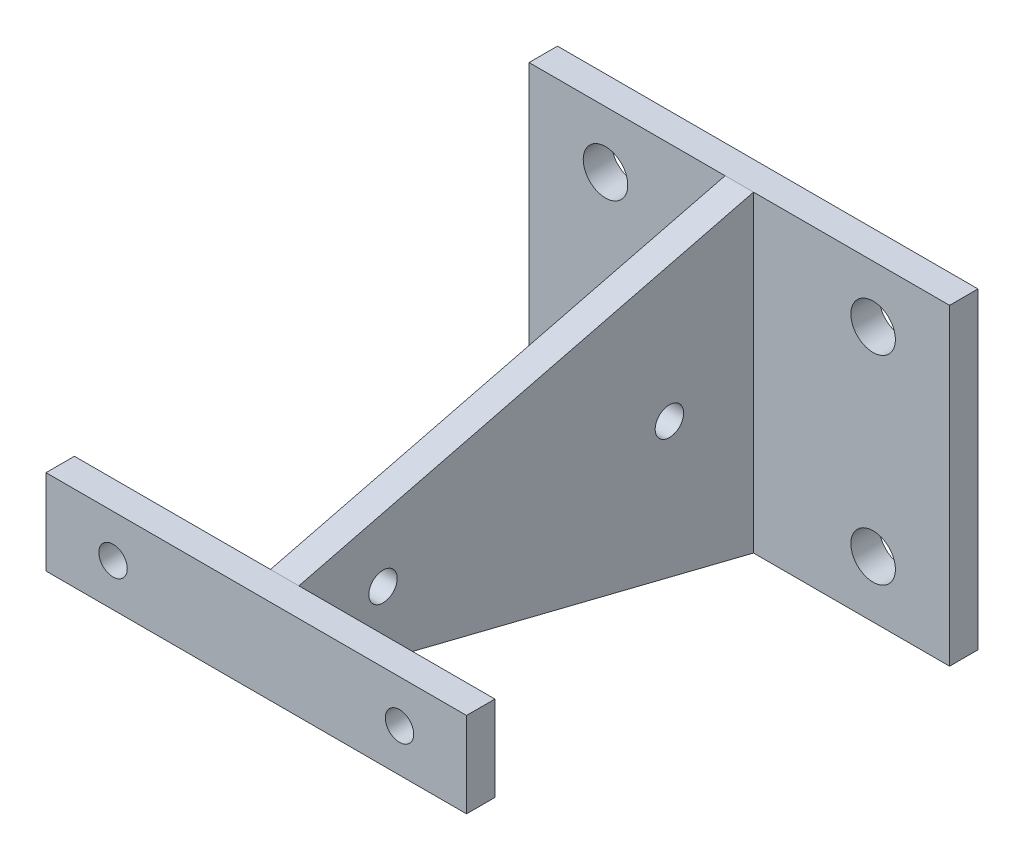
ISO-10303-21;
HEADER;
FILE_DESCRIPTION(('STEP AP214'),'2;1');
FILE_NAME('part.step','',(''),(''),'','','');
FILE_SCHEMA(('AUTOMOTIVE_DESIGN { 1 0 10303 214 1 1 1 1 }'));
ENDSEC;
DATA;
#1=APPLICATION_CONTEXT('core data for automotive mechanical design processes');
#2=APPLICATION_PROTOCOL_DEFINITION('international standard','automotive_design',2000,#1);
#3=PRODUCT_CONTEXT('',#1,'mechanical');
#4=PRODUCT('Part','Part','',(#3));
#5=PRODUCT_RELATED_PRODUCT_CATEGORY('part','',(#4));
#6=PRODUCT_DEFINITION_FORMATION('','',#4);
#7=PRODUCT_DEFINITION_CONTEXT('part definition',#1,'design');
#8=PRODUCT_DEFINITION('design','',#6,#7);
#9=PRODUCT_DEFINITION_SHAPE('','',#8);
#10=(LENGTH_UNIT() NAMED_UNIT(*) SI_UNIT(.MILLI.,.METRE.));
#11=(NAMED_UNIT(*) PLANE_ANGLE_UNIT() SI_UNIT($,.RADIAN.));
#12=(NAMED_UNIT(*) SI_UNIT($,.STERADIAN.) SOLID_ANGLE_UNIT());
#13=UNCERTAINTY_MEASURE_WITH_UNIT(LENGTH_MEASURE(1.E-05),#10,'distance_accuracy_value','');
#14=(GEOMETRIC_REPRESENTATION_CONTEXT(3) GLOBAL_UNCERTAINTY_ASSIGNED_CONTEXT((#13)) GLOBAL_UNIT_ASSIGNED_CONTEXT((#10,
#11,#12)) REPRESENTATION_CONTEXT('',''));
#15=CARTESIAN_POINT('',(0.,0.,0.));
#16=DIRECTION('',(0.,0.,1.));
#17=DIRECTION('',(1.,0.,0.));
#18=AXIS2_PLACEMENT_3D('',#15,#16,#17);
#19=CARTESIAN_POINT('',(0.,0.,0.));
#20=DIRECTION('',(0.,0.,-1.));
#21=DIRECTION('',(-1.,0.,0.));
#22=AXIS2_PLACEMENT_3D('',#19,#20,#21);
#23=PLANE('',#22);
#24=CARTESIAN_POINT('',(-16.002,0.,0.));
#25=DIRECTION('',(0.,0.,1.));
#26=DIRECTION('',(1.,0.,0.));
#27=AXIS2_PLACEMENT_3D('',#24,#25,#26);
#28=CIRCLE('',#27,1.5875);
#29=CARTESIAN_POINT('',(-14.4145,0.,0.));
#30=VERTEX_POINT('',#29);
#31=EDGE_CURVE('E201',#30,#30,#28,.T.);
#32=ORIENTED_EDGE('',*,*,#31,.T.);
#33=EDGE_LOOP('',(#32));
#34=FACE_BOUND('',#33,.T.);
#35=DIRECTION('',(-1.,0.,0.));
#36=VECTOR('',#35,1.);
#37=CARTESIAN_POINT('',(23.495,4.7625,0.));
#38=LINE('',#37,#36);
#39=CARTESIAN_POINT('',(-1.5875,4.7625,0.));
#40=VERTEX_POINT('',#39);
#41=CARTESIAN_POINT('',(-23.495,4.76249999999999,0.));
#42=VERTEX_POINT('',#41);
#43=EDGE_CURVE('E53',#40,#42,#38,.T.);
#44=ORIENTED_EDGE('',*,*,#43,.F.);
#45=DIRECTION('',(0.,-1.,0.));
#46=VECTOR('',#45,1.);
#47=CARTESIAN_POINT('',(-1.5875,4.7625,0.));
#48=LINE('',#47,#46);
#49=CARTESIAN_POINT('',(-1.5875,-4.7625,0.));
#50=VERTEX_POINT('',#49);
#51=EDGE_CURVE('E48',#40,#50,#48,.T.);
#52=ORIENTED_EDGE('',*,*,#51,.T.);
#53=DIRECTION('',(1.,0.,0.));
#54=VECTOR('',#53,1.);
#55=CARTESIAN_POINT('',(23.495,-4.7625,0.));
#56=LINE('',#55,#54);
#57=CARTESIAN_POINT('',(-23.495,-4.7625,0.));
#58=VERTEX_POINT('',#57);
#59=EDGE_CURVE('E224',#58,#50,#56,.T.);
#60=ORIENTED_EDGE('',*,*,#59,.F.);
#61=DIRECTION('',(0.,-1.,0.));
#62=VECTOR('',#61,1.);
#63=CARTESIAN_POINT('',(-23.495,4.76249999999999,0.));
#64=LINE('',#63,#62);
#65=EDGE_CURVE('E207',#42,#58,#64,.T.);
#66=ORIENTED_EDGE('',*,*,#65,.F.);
#67=EDGE_LOOP('',(#44,#52,#60,#66));
#68=FACE_BOUND('',#67,.T.);
#69=ADVANCED_FACE('F33',(#34,#68),#23,.T.);
#70=CARTESIAN_POINT('',(0.,0.,3.175));
#71=DIRECTION('',(0.,0.,-1.));
#72=DIRECTION('',(-1.,0.,0.));
#73=AXIS2_PLACEMENT_3D('',#70,#71,#72);
#74=PLANE('',#73);
#75=DIRECTION('',(0.,-1.,0.));
#76=VECTOR('',#75,1.);
#77=CARTESIAN_POINT('',(-23.495,4.76249999999999,3.175));
#78=LINE('',#77,#76);
#79=CARTESIAN_POINT('',(-23.495,4.76249999999999,3.175));
#80=VERTEX_POINT('',#79);
#81=CARTESIAN_POINT('',(-23.495,-4.7625,3.175));
#82=VERTEX_POINT('',#81);
#83=EDGE_CURVE('E210',#80,#82,#78,.T.);
#84=ORIENTED_EDGE('',*,*,#83,.T.);
#85=DIRECTION('',(1.,0.,0.));
#86=VECTOR('',#85,1.);
#87=CARTESIAN_POINT('',(23.495,-4.7625,3.175));
#88=LINE('',#87,#86);
#89=CARTESIAN_POINT('',(23.495,-4.7625,3.175));
#90=VERTEX_POINT('',#89);
#91=EDGE_CURVE('E213',#82,#90,#88,.T.);
#92=ORIENTED_EDGE('',*,*,#91,.T.);
#93=DIRECTION('',(0.,1.,0.));
#94=VECTOR('',#93,1.);
#95=CARTESIAN_POINT('',(23.495,4.7625,3.175));
#96=LINE('',#95,#94);
#97=CARTESIAN_POINT('',(23.495,4.7625,3.175));
#98=VERTEX_POINT('',#97);
#99=EDGE_CURVE('E216',#90,#98,#96,.T.);
#100=ORIENTED_EDGE('',*,*,#99,.T.);
#101=DIRECTION('',(-1.,0.,0.));
#102=VECTOR('',#101,1.);
#103=CARTESIAN_POINT('',(23.495,4.7625,3.175));
#104=LINE('',#103,#102);
#105=EDGE_CURVE('E218',#98,#80,#104,.T.);
#106=ORIENTED_EDGE('',*,*,#105,.T.);
#107=EDGE_LOOP('',(#84,#92,#100,#106));
#108=FACE_BOUND('',#107,.T.);
#109=CARTESIAN_POINT('',(-16.002,0.,3.175));
#110=DIRECTION('',(0.,0.,1.));
#111=DIRECTION('',(1.,0.,0.));
#112=AXIS2_PLACEMENT_3D('',#109,#110,#111);
#113=CIRCLE('',#112,1.5875);
#114=CARTESIAN_POINT('',(-14.4145,0.,3.175));
#115=VERTEX_POINT('',#114);
#116=EDGE_CURVE('E204',#115,#115,#113,.T.);
#117=ORIENTED_EDGE('',*,*,#116,.F.);
#118=EDGE_LOOP('',(#117));
#119=FACE_BOUND('',#118,.T.);
#120=CARTESIAN_POINT('',(16.002,0.,3.175));
#121=DIRECTION('',(0.,0.,1.));
#122=DIRECTION('',(1.,0.,0.));
#123=AXIS2_PLACEMENT_3D('',#120,#121,#122);
#124=CIRCLE('',#123,1.5875);
#125=CARTESIAN_POINT('',(17.5895,0.,3.175));
#126=VERTEX_POINT('',#125);
#127=EDGE_CURVE('E198',#126,#126,#124,.T.);
#128=ORIENTED_EDGE('',*,*,#127,.F.);
#129=EDGE_LOOP('',(#128));
#130=FACE_BOUND('',#129,.T.);
#131=ADVANCED_FACE('F273',(#108,#119,#130),#74,.F.);
#132=DIRECTION('',(0.,-1.,0.));
#133=VECTOR('',#132,1.);
#134=CARTESIAN_POINT('',(1.5875,4.7625,0.));
#135=LINE('',#134,#133);
#136=CARTESIAN_POINT('',(1.5875,4.7625,0.));
#137=VERTEX_POINT('',#136);
#138=CARTESIAN_POINT('',(1.5875,-4.7625,0.));
#139=VERTEX_POINT('',#138);
#140=EDGE_CURVE('E165',#137,#139,#135,.T.);
#141=ORIENTED_EDGE('',*,*,#140,.F.);
#142=CARTESIAN_POINT('',(23.495,4.7625,0.));
#143=VERTEX_POINT('',#142);
#144=EDGE_CURVE('E214',#143,#137,#38,.T.);
#145=ORIENTED_EDGE('',*,*,#144,.F.);
#146=DIRECTION('',(0.,1.,0.));
#147=VECTOR('',#146,1.);
#148=CARTESIAN_POINT('',(23.495,4.7625,0.));
#149=LINE('',#148,#147);
#150=CARTESIAN_POINT('',(23.495,-4.7625,0.));
#151=VERTEX_POINT('',#150);
#152=EDGE_CURVE('E226',#151,#143,#149,.T.);
#153=ORIENTED_EDGE('',*,*,#152,.F.);
#154=EDGE_CURVE('E223',#139,#151,#56,.T.);
#155=ORIENTED_EDGE('',*,*,#154,.F.);
#156=EDGE_LOOP('',(#141,#145,#153,#155));
#157=FACE_BOUND('',#156,.T.);
#158=CARTESIAN_POINT('',(16.002,0.,0.));
#159=DIRECTION('',(0.,0.,1.));
#160=DIRECTION('',(1.,0.,0.));
#161=AXIS2_PLACEMENT_3D('',#158,#159,#160);
#162=CIRCLE('',#161,1.5875);
#163=CARTESIAN_POINT('',(17.5895,0.,0.));
#164=VERTEX_POINT('',#163);
#165=EDGE_CURVE('E197',#164,#164,#162,.T.);
#166=ORIENTED_EDGE('',*,*,#165,.T.);
#167=EDGE_LOOP('',(#166));
#168=FACE_BOUND('',#167,.T.);
#169=ADVANCED_FACE('F245',(#157,#168),#23,.T.);
#170=CARTESIAN_POINT('',(-23.495,4.76249999999999,3.175));
#171=DIRECTION('',(1.,0.,0.));
#172=DIRECTION('',(0.,0.,-1.));
#173=AXIS2_PLACEMENT_3D('',#170,#171,#172);
#174=PLANE('',#173);
#175=ORIENTED_EDGE('',*,*,#65,.T.);
#176=DIRECTION('',(0.,0.,-1.));
#177=VECTOR('',#176,1.);
#178=CARTESIAN_POINT('',(-23.495,-4.7625,3.175));
#179=LINE('',#178,#177);
#180=EDGE_CURVE('E11',#82,#58,#179,.T.);
#181=ORIENTED_EDGE('',*,*,#180,.F.);
#182=ORIENTED_EDGE('',*,*,#83,.F.);
#183=DIRECTION('',(0.,0.,-1.));
#184=VECTOR('',#183,1.);
#185=CARTESIAN_POINT('',(-23.495,4.76249999999999,3.175));
#186=LINE('',#185,#184);
#187=EDGE_CURVE('E220',#80,#42,#186,.T.);
#188=ORIENTED_EDGE('',*,*,#187,.T.);
#189=EDGE_LOOP('',(#175,#181,#182,#188));
#190=FACE_BOUND('',#189,.T.);
#191=ADVANCED_FACE('F35',(#190),#174,.F.);
#192=CARTESIAN_POINT('',(23.495,-4.7625,3.175));
#193=DIRECTION('',(0.,1.,0.));
#194=DIRECTION('',(0.,0.,1.));
#195=AXIS2_PLACEMENT_3D('',#192,#193,#194);
#196=PLANE('',#195);
#197=ORIENTED_EDGE('',*,*,#59,.T.);
#198=DIRECTION('',(-1.,0.,0.));
#199=VECTOR('',#198,1.);
#200=CARTESIAN_POINT('',(1.5875,-4.7625,0.));
#201=LINE('',#200,#199);
#202=EDGE_CURVE('E194',#139,#50,#201,.T.);
#203=ORIENTED_EDGE('',*,*,#202,.F.);
#204=ORIENTED_EDGE('',*,*,#154,.T.);
#205=DIRECTION('',(0.,0.,-1.));
#206=VECTOR('',#205,1.);
#207=CARTESIAN_POINT('',(23.495,-4.7625,3.175));
#208=LINE('',#207,#206);
#209=EDGE_CURVE('E41',#90,#151,#208,.T.);
#210=ORIENTED_EDGE('',*,*,#209,.F.);
#211=ORIENTED_EDGE('',*,*,#91,.F.);
#212=ORIENTED_EDGE('',*,*,#180,.T.);
#213=EDGE_LOOP('',(#197,#203,#204,#210,#211,#212));
#214=FACE_BOUND('',#213,.T.);
#215=ADVANCED_FACE('F267',(#214),#196,.F.);
#216=CARTESIAN_POINT('',(23.495,4.7625,3.175));
#217=DIRECTION('',(-1.,0.,0.));
#218=DIRECTION('',(0.,0.,1.));
#219=AXIS2_PLACEMENT_3D('',#216,#217,#218);
#220=PLANE('',#219);
#221=ORIENTED_EDGE('',*,*,#152,.T.);
#222=DIRECTION('',(0.,0.,-1.));
#223=VECTOR('',#222,1.);
#224=CARTESIAN_POINT('',(23.495,4.7625,3.175));
#225=LINE('',#224,#223);
#226=EDGE_CURVE('E232',#98,#143,#225,.T.);
#227=ORIENTED_EDGE('',*,*,#226,.F.);
#228=ORIENTED_EDGE('',*,*,#99,.F.);
#229=ORIENTED_EDGE('',*,*,#209,.T.);
#230=EDGE_LOOP('',(#221,#227,#228,#229));
#231=FACE_BOUND('',#230,.T.);
#232=ADVANCED_FACE('F239',(#231),#220,.F.);
#233=CARTESIAN_POINT('',(23.495,4.7625,3.175));
#234=DIRECTION('',(0.,-1.,0.));
#235=DIRECTION('',(1.,0.,0.));
#236=AXIS2_PLACEMENT_3D('',#233,#234,#235);
#237=PLANE('',#236);
#238=ORIENTED_EDGE('',*,*,#144,.T.);
#239=DIRECTION('',(-1.,0.,0.));
#240=VECTOR('',#239,1.);
#241=CARTESIAN_POINT('',(1.5875,4.7625,0.));
#242=LINE('',#241,#240);
#243=EDGE_CURVE('E178',#137,#40,#242,.T.);
#244=ORIENTED_EDGE('',*,*,#243,.T.);
#245=ORIENTED_EDGE('',*,*,#43,.T.);
#246=ORIENTED_EDGE('',*,*,#187,.F.);
#247=ORIENTED_EDGE('',*,*,#105,.F.);
#248=ORIENTED_EDGE('',*,*,#226,.T.);
#249=EDGE_LOOP('',(#238,#244,#245,#246,#247,#248));
#250=FACE_BOUND('',#249,.T.);
#251=ADVANCED_FACE('F249',(#250),#237,.F.);
#252=CARTESIAN_POINT('',(-16.002,0.,3.175));
#253=DIRECTION('',(0.,0.,-1.));
#254=DIRECTION('',(-1.,0.,0.));
#255=AXIS2_PLACEMENT_3D('',#252,#253,#254);
#256=CYLINDRICAL_SURFACE('',#255,1.5875);
#257=ORIENTED_EDGE('',*,*,#116,.T.);
#258=EDGE_LOOP('',(#257));
#259=FACE_BOUND('',#258,.T.);
#260=ORIENTED_EDGE('',*,*,#31,.F.);
#261=EDGE_LOOP('',(#260));
#262=FACE_BOUND('',#261,.T.);
#263=ADVANCED_FACE('F284',(#259,#262),#256,.F.);
#264=CARTESIAN_POINT('',(16.002,0.,3.175));
#265=DIRECTION('',(0.,0.,-1.));
#266=DIRECTION('',(-1.,0.,0.));
#267=AXIS2_PLACEMENT_3D('',#264,#265,#266);
#268=CYLINDRICAL_SURFACE('',#267,1.5875);
#269=ORIENTED_EDGE('',*,*,#127,.T.);
#270=EDGE_LOOP('',(#269));
#271=FACE_BOUND('',#270,.T.);
#272=ORIENTED_EDGE('',*,*,#165,.F.);
#273=EDGE_LOOP('',(#272));
#274=FACE_BOUND('',#273,.T.);
#275=ADVANCED_FACE('F281',(#271,#274),#268,.F.);
#276=CARTESIAN_POINT('',(1.5875,0.,0.));
#277=DIRECTION('',(-1.,0.,0.));
#278=DIRECTION('',(0.,0.,1.));
#279=AXIS2_PLACEMENT_3D('',#276,#277,#278);
#280=PLANE('',#279);
#281=ORIENTED_EDGE('',*,*,#140,.T.);
#282=DIRECTION('',(0.,-0.242535625036333,-0.970142500145332));
#283=VECTOR('',#282,1.);
#284=CARTESIAN_POINT('',(1.5875,-17.4625,-50.8));
#285=LINE('',#284,#283);
#286=CARTESIAN_POINT('',(1.5875,-17.4625,-50.8));
#287=VERTEX_POINT('',#286);
#288=EDGE_CURVE('E168',#139,#287,#285,.T.);
#289=ORIENTED_EDGE('',*,*,#288,.T.);
#290=DIRECTION('',(0.,1.,0.));
#291=VECTOR('',#290,1.);
#292=CARTESIAN_POINT('',(1.5875,17.4625,-50.8));
#293=LINE('',#292,#291);
#294=CARTESIAN_POINT('',(1.5875,17.4625,-50.8));
#295=VERTEX_POINT('',#294);
#296=EDGE_CURVE('E172',#287,#295,#293,.T.);
#297=ORIENTED_EDGE('',*,*,#296,.T.);
#298=DIRECTION('',(0.,-0.242535625036333,0.970142500145332));
#299=VECTOR('',#298,1.);
#300=CARTESIAN_POINT('',(1.5875,17.4625,-50.8));
#301=LINE('',#300,#299);
#302=EDGE_CURVE('E175',#295,#137,#301,.T.);
#303=ORIENTED_EDGE('',*,*,#302,.T.);
#304=EDGE_LOOP('',(#281,#289,#297,#303));
#305=FACE_BOUND('',#304,.T.);
#306=CARTESIAN_POINT('',(1.5875,0.,-9.398));
#307=DIRECTION('',(1.,0.,0.));
#308=DIRECTION('',(0.,0.,-1.));
#309=AXIS2_PLACEMENT_3D('',#306,#307,#308);
#310=CIRCLE('',#309,1.5875);
#311=CARTESIAN_POINT('',(1.5875,0.,-10.9855));
#312=VERTEX_POINT('',#311);
#313=EDGE_CURVE('E160',#312,#312,#310,.T.);
#314=ORIENTED_EDGE('',*,*,#313,.F.);
#315=EDGE_LOOP('',(#314));
#316=FACE_BOUND('',#315,.T.);
#317=CARTESIAN_POINT('',(1.5875,0.,-41.402));
#318=DIRECTION('',(1.,0.,0.));
#319=DIRECTION('',(0.,0.,-1.));
#320=AXIS2_PLACEMENT_3D('',#317,#318,#319);
#321=CIRCLE('',#320,1.5875);
#322=CARTESIAN_POINT('',(1.5875,0.,-42.9895));
#323=VERTEX_POINT('',#322);
#324=EDGE_CURVE('E151',#323,#323,#321,.T.);
#325=ORIENTED_EDGE('',*,*,#324,.F.);
#326=EDGE_LOOP('',(#325));
#327=FACE_BOUND('',#326,.T.);
#328=ADVANCED_FACE('F254',(#305,#316,#327),#280,.F.);
#329=CARTESIAN_POINT('',(-1.5875,0.,0.));
#330=DIRECTION('',(-1.,0.,0.));
#331=DIRECTION('',(0.,0.,1.));
#332=AXIS2_PLACEMENT_3D('',#329,#330,#331);
#333=PLANE('',#332);
#334=CARTESIAN_POINT('',(-1.5875,0.,-9.398));
#335=DIRECTION('',(1.,0.,0.));
#336=DIRECTION('',(0.,0.,-1.));
#337=AXIS2_PLACEMENT_3D('',#334,#335,#336);
#338=CIRCLE('',#337,1.5875);
#339=CARTESIAN_POINT('',(-1.5875,0.,-10.9855));
#340=VERTEX_POINT('',#339);
#341=EDGE_CURVE('E158',#340,#340,#338,.T.);
#342=ORIENTED_EDGE('',*,*,#341,.T.);
#343=EDGE_LOOP('',(#342));
#344=FACE_BOUND('',#343,.T.);
#345=ORIENTED_EDGE('',*,*,#51,.F.);
#346=DIRECTION('',(0.,-0.242535625036333,0.970142500145332));
#347=VECTOR('',#346,1.);
#348=CARTESIAN_POINT('',(-1.5875,17.4625,-50.8));
#349=LINE('',#348,#347);
#350=CARTESIAN_POINT('',(-1.5875,17.4625,-50.8));
#351=VERTEX_POINT('',#350);
#352=EDGE_CURVE('E169',#351,#40,#349,.T.);
#353=ORIENTED_EDGE('',*,*,#352,.F.);
#354=DIRECTION('',(0.,1.,0.));
#355=VECTOR('',#354,1.);
#356=CARTESIAN_POINT('',(-1.5875,17.4625,-50.8));
#357=LINE('',#356,#355);
#358=CARTESIAN_POINT('',(-1.5875,-17.4625,-50.8));
#359=VERTEX_POINT('',#358);
#360=EDGE_CURVE('E183',#359,#351,#357,.T.);
#361=ORIENTED_EDGE('',*,*,#360,.F.);
#362=DIRECTION('',(0.,-0.242535625036333,-0.970142500145332));
#363=VECTOR('',#362,1.);
#364=CARTESIAN_POINT('',(-1.5875,-17.4625,-50.8));
#365=LINE('',#364,#363);
#366=EDGE_CURVE('E180',#50,#359,#365,.T.);
#367=ORIENTED_EDGE('',*,*,#366,.F.);
#368=EDGE_LOOP('',(#345,#353,#361,#367));
#369=FACE_BOUND('',#368,.T.);
#370=CARTESIAN_POINT('',(-1.5875,0.,-41.402));
#371=DIRECTION('',(1.,0.,0.));
#372=DIRECTION('',(0.,0.,-1.));
#373=AXIS2_PLACEMENT_3D('',#370,#371,#372);
#374=CIRCLE('',#373,1.5875);
#375=CARTESIAN_POINT('',(-1.5875,0.,-42.9895));
#376=VERTEX_POINT('',#375);
#377=EDGE_CURVE('E148',#376,#376,#374,.T.);
#378=ORIENTED_EDGE('',*,*,#377,.T.);
#379=EDGE_LOOP('',(#378));
#380=FACE_BOUND('',#379,.T.);
#381=ADVANCED_FACE('F262',(#344,#369,#380),#333,.T.);
#382=CARTESIAN_POINT('',(1.5875,-17.4625,-50.8));
#383=DIRECTION('',(0.,0.970142500145332,-0.242535625036333));
#384=DIRECTION('',(0.,0.242535625036333,0.970142500145332));
#385=AXIS2_PLACEMENT_3D('',#382,#383,#384);
#386=PLANE('',#385);
#387=ORIENTED_EDGE('',*,*,#366,.T.);
#388=DIRECTION('',(-1.,0.,0.));
#389=VECTOR('',#388,1.);
#390=CARTESIAN_POINT('',(1.5875,-17.4625,-50.8));
#391=LINE('',#390,#389);
#392=EDGE_CURVE('E191',#287,#359,#391,.T.);
#393=ORIENTED_EDGE('',*,*,#392,.F.);
#394=ORIENTED_EDGE('',*,*,#288,.F.);
#395=ORIENTED_EDGE('',*,*,#202,.T.);
#396=EDGE_LOOP('',(#387,#393,#394,#395));
#397=FACE_BOUND('',#396,.T.);
#398=ADVANCED_FACE('F266',(#397),#386,.F.);
#399=CARTESIAN_POINT('',(1.5875,17.4625,-50.8));
#400=DIRECTION('',(0.,-0.970142500145332,-0.242535625036333));
#401=DIRECTION('',(0.,0.242535625036333,-0.970142500145332));
#402=AXIS2_PLACEMENT_3D('',#399,#400,#401);
#403=PLANE('',#402);
#404=ORIENTED_EDGE('',*,*,#352,.T.);
#405=ORIENTED_EDGE('',*,*,#243,.F.);
#406=ORIENTED_EDGE('',*,*,#302,.F.);
#407=DIRECTION('',(-1.,0.,0.));
#408=VECTOR('',#407,1.);
#409=CARTESIAN_POINT('',(1.5875,17.4625,-50.8));
#410=LINE('',#409,#408);
#411=EDGE_CURVE('E188',#295,#351,#410,.T.);
#412=ORIENTED_EDGE('',*,*,#411,.T.);
#413=EDGE_LOOP('',(#404,#405,#406,#412));
#414=FACE_BOUND('',#413,.T.);
#415=ADVANCED_FACE('F257',(#414),#403,.F.);
#416=CARTESIAN_POINT('',(1.5875,0.,-9.398));
#417=DIRECTION('',(-1.,0.,0.));
#418=DIRECTION('',(0.,0.,1.));
#419=AXIS2_PLACEMENT_3D('',#416,#417,#418);
#420=CYLINDRICAL_SURFACE('',#419,1.5875);
#421=ORIENTED_EDGE('',*,*,#313,.T.);
#422=EDGE_LOOP('',(#421));
#423=FACE_BOUND('',#422,.T.);
#424=ORIENTED_EDGE('',*,*,#341,.F.);
#425=EDGE_LOOP('',(#424));
#426=FACE_BOUND('',#425,.T.);
#427=ADVANCED_FACE('F310',(#423,#426),#420,.F.);
#428=CARTESIAN_POINT('',(1.5875,0.,-41.402));
#429=DIRECTION('',(-1.,0.,0.));
#430=DIRECTION('',(0.,0.,1.));
#431=AXIS2_PLACEMENT_3D('',#428,#429,#430);
#432=CYLINDRICAL_SURFACE('',#431,1.5875);
#433=ORIENTED_EDGE('',*,*,#324,.T.);
#434=EDGE_LOOP('',(#433));
#435=FACE_BOUND('',#434,.T.);
#436=ORIENTED_EDGE('',*,*,#377,.F.);
#437=EDGE_LOOP('',(#436));
#438=FACE_BOUND('',#437,.T.);
#439=ADVANCED_FACE('F318',(#435,#438),#432,.F.);
#440=CARTESIAN_POINT('',(0.,0.,-50.8));
#441=DIRECTION('',(0.,0.,-1.));
#442=DIRECTION('',(-1.,0.,0.));
#443=AXIS2_PLACEMENT_3D('',#440,#441,#442);
#444=PLANE('',#443);
#445=CARTESIAN_POINT('',(-14.9513636363636,-11.1125,-50.8));
#446=DIRECTION('',(0.,0.,-1.));
#447=DIRECTION('',(-1.,0.,0.));
#448=AXIS2_PLACEMENT_3D('',#445,#446,#447);
#449=CIRCLE('',#448,2.4892);
#450=CARTESIAN_POINT('',(-17.4405636363636,-11.1125,-50.8));
#451=VERTEX_POINT('',#450);
#452=EDGE_CURVE('E369',#451,#451,#449,.T.);
#453=ORIENTED_EDGE('',*,*,#452,.T.);
#454=EDGE_LOOP('',(#453));
#455=FACE_BOUND('',#454,.T.);
#456=CARTESIAN_POINT('',(-14.9513636363636,11.1125,-50.8));
#457=DIRECTION('',(0.,0.,-1.));
#458=DIRECTION('',(-1.,0.,0.));
#459=AXIS2_PLACEMENT_3D('',#456,#457,#458);
#460=CIRCLE('',#459,2.4892);
#461=CARTESIAN_POINT('',(-17.4405636363636,11.1125,-50.8));
#462=VERTEX_POINT('',#461);
#463=EDGE_CURVE('E375',#462,#462,#460,.T.);
#464=ORIENTED_EDGE('',*,*,#463,.T.);
#465=EDGE_LOOP('',(#464));
#466=FACE_BOUND('',#465,.T.);
#467=DIRECTION('',(-1.,0.,0.));
#468=VECTOR('',#467,1.);
#469=CARTESIAN_POINT('',(23.495,-17.4625,-50.8));
#470=LINE('',#469,#468);
#471=CARTESIAN_POINT('',(-23.495,-17.4625,-50.8));
#472=VERTEX_POINT('',#471);
#473=EDGE_CURVE('E398',#359,#472,#470,.T.);
#474=ORIENTED_EDGE('',*,*,#473,.F.);
#475=ORIENTED_EDGE('',*,*,#360,.T.);
#476=DIRECTION('',(1.,0.,0.));
#477=VECTOR('',#476,1.);
#478=CARTESIAN_POINT('',(23.495,17.4625,-50.8));
#479=LINE('',#478,#477);
#480=CARTESIAN_POINT('',(-23.495,17.4625,-50.8));
#481=VERTEX_POINT('',#480);
#482=EDGE_CURVE('E394',#481,#351,#479,.T.);
#483=ORIENTED_EDGE('',*,*,#482,.F.);
#484=DIRECTION('',(0.,1.,0.));
#485=VECTOR('',#484,1.);
#486=CARTESIAN_POINT('',(-23.495,17.4625,-50.8));
#487=LINE('',#486,#485);
#488=EDGE_CURVE('E147',#472,#481,#487,.T.);
#489=ORIENTED_EDGE('',*,*,#488,.F.);
#490=EDGE_LOOP('',(#474,#475,#483,#489));
#491=FACE_BOUND('',#490,.T.);
#492=ADVANCED_FACE('F322',(#455,#466,#491),#444,.F.);
#493=CARTESIAN_POINT('',(0.,0.,-53.975));
#494=DIRECTION('',(0.,0.,-1.));
#495=DIRECTION('',(-1.,0.,0.));
#496=AXIS2_PLACEMENT_3D('',#493,#494,#495);
#497=PLANE('',#496);
#498=CARTESIAN_POINT('',(-14.9513636363636,-11.1125,-53.975));
#499=DIRECTION('',(0.,0.,-1.));
#500=DIRECTION('',(-1.,0.,0.));
#501=AXIS2_PLACEMENT_3D('',#498,#499,#500);
#502=CIRCLE('',#501,2.4892);
#503=CARTESIAN_POINT('',(-17.4405636363636,-11.1125,-53.975));
#504=VERTEX_POINT('',#503);
#505=EDGE_CURVE('E372',#504,#504,#502,.T.);
#506=ORIENTED_EDGE('',*,*,#505,.F.);
#507=EDGE_LOOP('',(#506));
#508=FACE_BOUND('',#507,.T.);
#509=CARTESIAN_POINT('',(14.9513636363636,11.1125,-53.975));
#510=DIRECTION('',(0.,0.,-1.));
#511=DIRECTION('',(-1.,0.,0.));
#512=AXIS2_PLACEMENT_3D('',#509,#510,#511);
#513=CIRCLE('',#512,2.4892);
#514=CARTESIAN_POINT('',(12.4621636363636,11.1125,-53.975));
#515=VERTEX_POINT('',#514);
#516=EDGE_CURVE('E384',#515,#515,#513,.T.);
#517=ORIENTED_EDGE('',*,*,#516,.F.);
#518=EDGE_LOOP('',(#517));
#519=FACE_BOUND('',#518,.T.);
#520=DIRECTION('',(0.,1.,0.));
#521=VECTOR('',#520,1.);
#522=CARTESIAN_POINT('',(-23.495,17.4625,-53.975));
#523=LINE('',#522,#521);
#524=CARTESIAN_POINT('',(-23.495,-17.4625,-53.975));
#525=VERTEX_POINT('',#524);
#526=CARTESIAN_POINT('',(-23.495,17.4625,-53.975));
#527=VERTEX_POINT('',#526);
#528=EDGE_CURVE('E133',#525,#527,#523,.T.);
#529=ORIENTED_EDGE('',*,*,#528,.T.);
#530=DIRECTION('',(1.,0.,0.));
#531=VECTOR('',#530,1.);
#532=CARTESIAN_POINT('',(23.495,17.4625,-53.975));
#533=LINE('',#532,#531);
#534=CARTESIAN_POINT('',(23.495,17.4625,-53.975));
#535=VERTEX_POINT('',#534);
#536=EDGE_CURVE('E121',#527,#535,#533,.T.);
#537=ORIENTED_EDGE('',*,*,#536,.T.);
#538=DIRECTION('',(0.,-1.,0.));
#539=VECTOR('',#538,1.);
#540=CARTESIAN_POINT('',(23.495,17.4625,-53.975));
#541=LINE('',#540,#539);
#542=CARTESIAN_POINT('',(23.495,-17.4625,-53.975));
#543=VERTEX_POINT('',#542);
#544=EDGE_CURVE('E132',#535,#543,#541,.T.);
#545=ORIENTED_EDGE('',*,*,#544,.T.);
#546=DIRECTION('',(-1.,0.,0.));
#547=VECTOR('',#546,1.);
#548=CARTESIAN_POINT('',(23.495,-17.4625,-53.975));
#549=LINE('',#548,#547);
#550=EDGE_CURVE('E139',#543,#525,#549,.T.);
#551=ORIENTED_EDGE('',*,*,#550,.T.);
#552=EDGE_LOOP('',(#529,#537,#545,#551));
#553=FACE_BOUND('',#552,.T.);
#554=CARTESIAN_POINT('',(-14.9513636363636,11.1125,-53.975));
#555=DIRECTION('',(0.,0.,-1.));
#556=DIRECTION('',(-1.,0.,0.));
#557=AXIS2_PLACEMENT_3D('',#554,#555,#556);
#558=CIRCLE('',#557,2.4892);
#559=CARTESIAN_POINT('',(-17.4405636363636,11.1125,-53.975));
#560=VERTEX_POINT('',#559);
#561=EDGE_CURVE('E378',#560,#560,#558,.T.);
#562=ORIENTED_EDGE('',*,*,#561,.F.);
#563=EDGE_LOOP('',(#562));
#564=FACE_BOUND('',#563,.T.);
#565=CARTESIAN_POINT('',(14.9513636363636,-11.1125,-53.975));
#566=DIRECTION('',(0.,0.,-1.));
#567=DIRECTION('',(-1.,0.,0.));
#568=AXIS2_PLACEMENT_3D('',#565,#566,#567);
#569=CIRCLE('',#568,2.4892);
#570=CARTESIAN_POINT('',(12.4621636363636,-11.1125,-53.975));
#571=VERTEX_POINT('',#570);
#572=EDGE_CURVE('E363',#571,#571,#569,.T.);
#573=ORIENTED_EDGE('',*,*,#572,.F.);
#574=EDGE_LOOP('',(#573));
#575=FACE_BOUND('',#574,.T.);
#576=ADVANCED_FACE('F136',(#508,#519,#553,#564,#575),#497,.T.);
#577=ORIENTED_EDGE('',*,*,#296,.F.);
#578=CARTESIAN_POINT('',(23.495,-17.4625,-50.8));
#579=VERTEX_POINT('',#578);
#580=EDGE_CURVE('E143',#579,#287,#470,.T.);
#581=ORIENTED_EDGE('',*,*,#580,.F.);
#582=DIRECTION('',(0.,-1.,0.));
#583=VECTOR('',#582,1.);
#584=CARTESIAN_POINT('',(23.495,17.4625,-50.8));
#585=LINE('',#584,#583);
#586=CARTESIAN_POINT('',(23.495,17.4625,-50.8));
#587=VERTEX_POINT('',#586);
#588=EDGE_CURVE('E396',#587,#579,#585,.T.);
#589=ORIENTED_EDGE('',*,*,#588,.F.);
#590=EDGE_CURVE('E393',#295,#587,#479,.T.);
#591=ORIENTED_EDGE('',*,*,#590,.F.);
#592=EDGE_LOOP('',(#577,#581,#589,#591));
#593=FACE_BOUND('',#592,.T.);
#594=CARTESIAN_POINT('',(14.9513636363636,11.1125,-50.8));
#595=DIRECTION('',(0.,0.,-1.));
#596=DIRECTION('',(-1.,0.,0.));
#597=AXIS2_PLACEMENT_3D('',#594,#595,#596);
#598=CIRCLE('',#597,2.4892);
#599=CARTESIAN_POINT('',(12.4621636363636,11.1125,-50.8));
#600=VERTEX_POINT('',#599);
#601=EDGE_CURVE('E381',#600,#600,#598,.T.);
#602=ORIENTED_EDGE('',*,*,#601,.T.);
#603=EDGE_LOOP('',(#602));
#604=FACE_BOUND('',#603,.T.);
#605=CARTESIAN_POINT('',(14.9513636363636,-11.1125,-50.8));
#606=DIRECTION('',(0.,0.,-1.));
#607=DIRECTION('',(-1.,0.,0.));
#608=AXIS2_PLACEMENT_3D('',#605,#606,#607);
#609=CIRCLE('',#608,2.4892);
#610=CARTESIAN_POINT('',(12.4621636363636,-11.1125,-50.8));
#611=VERTEX_POINT('',#610);
#612=EDGE_CURVE('E366',#611,#611,#609,.T.);
#613=ORIENTED_EDGE('',*,*,#612,.T.);
#614=EDGE_LOOP('',(#613));
#615=FACE_BOUND('',#614,.T.);
#616=ADVANCED_FACE('F326',(#593,#604,#615),#444,.F.);
#617=CARTESIAN_POINT('',(-23.495,17.4625,-53.975));
#618=DIRECTION('',(1.,0.,0.));
#619=DIRECTION('',(0.,0.,-1.));
#620=AXIS2_PLACEMENT_3D('',#617,#618,#619);
#621=PLANE('',#620);
#622=ORIENTED_EDGE('',*,*,#488,.T.);
#623=DIRECTION('',(0.,0.,1.));
#624=VECTOR('',#623,1.);
#625=CARTESIAN_POINT('',(-23.495,17.4625,-53.975));
#626=LINE('',#625,#624);
#627=EDGE_CURVE('E126',#527,#481,#626,.T.);
#628=ORIENTED_EDGE('',*,*,#627,.F.);
#629=ORIENTED_EDGE('',*,*,#528,.F.);
#630=DIRECTION('',(0.,0.,1.));
#631=VECTOR('',#630,1.);
#632=CARTESIAN_POINT('',(-23.495,-17.4625,-53.975));
#633=LINE('',#632,#631);
#634=EDGE_CURVE('E391',#525,#472,#633,.T.);
#635=ORIENTED_EDGE('',*,*,#634,.T.);
#636=EDGE_LOOP('',(#622,#628,#629,#635));
#637=FACE_BOUND('',#636,.T.);
#638=ADVANCED_FACE('F145',(#637),#621,.F.);
#639=CARTESIAN_POINT('',(23.495,17.4625,-53.975));
#640=DIRECTION('',(0.,-1.,0.));
#641=DIRECTION('',(0.,0.,-1.));
#642=AXIS2_PLACEMENT_3D('',#639,#640,#641);
#643=PLANE('',#642);
#644=ORIENTED_EDGE('',*,*,#482,.T.);
#645=ORIENTED_EDGE('',*,*,#411,.F.);
#646=ORIENTED_EDGE('',*,*,#590,.T.);
#647=DIRECTION('',(0.,0.,1.));
#648=VECTOR('',#647,1.);
#649=CARTESIAN_POINT('',(23.495,17.4625,-53.975));
#650=LINE('',#649,#648);
#651=EDGE_CURVE('E129',#535,#587,#650,.T.);
#652=ORIENTED_EDGE('',*,*,#651,.F.);
#653=ORIENTED_EDGE('',*,*,#536,.F.);
#654=ORIENTED_EDGE('',*,*,#627,.T.);
#655=EDGE_LOOP('',(#644,#645,#646,#652,#653,#654));
#656=FACE_BOUND('',#655,.T.);
#657=ADVANCED_FACE('F124',(#656),#643,.F.);
#658=CARTESIAN_POINT('',(23.495,17.4625,-53.975));
#659=DIRECTION('',(-1.,0.,0.));
#660=DIRECTION('',(0.,0.,1.));
#661=AXIS2_PLACEMENT_3D('',#658,#659,#660);
#662=PLANE('',#661);
#663=ORIENTED_EDGE('',*,*,#588,.T.);
#664=DIRECTION('',(0.,0.,1.));
#665=VECTOR('',#664,1.);
#666=CARTESIAN_POINT('',(23.495,-17.4625,-53.975));
#667=LINE('',#666,#665);
#668=EDGE_CURVE('E153',#543,#579,#667,.T.);
#669=ORIENTED_EDGE('',*,*,#668,.F.);
#670=ORIENTED_EDGE('',*,*,#544,.F.);
#671=ORIENTED_EDGE('',*,*,#651,.T.);
#672=EDGE_LOOP('',(#663,#669,#670,#671));
#673=FACE_BOUND('',#672,.T.);
#674=ADVANCED_FACE('F329',(#673),#662,.F.);
#675=CARTESIAN_POINT('',(23.495,-17.4625,-53.975));
#676=DIRECTION('',(0.,1.,0.));
#677=DIRECTION('',(0.,0.,1.));
#678=AXIS2_PLACEMENT_3D('',#675,#676,#677);
#679=PLANE('',#678);
#680=ORIENTED_EDGE('',*,*,#580,.T.);
#681=ORIENTED_EDGE('',*,*,#392,.T.);
#682=ORIENTED_EDGE('',*,*,#473,.T.);
#683=ORIENTED_EDGE('',*,*,#634,.F.);
#684=ORIENTED_EDGE('',*,*,#550,.F.);
#685=ORIENTED_EDGE('',*,*,#668,.T.);
#686=EDGE_LOOP('',(#680,#681,#682,#683,#684,#685));
#687=FACE_BOUND('',#686,.T.);
#688=ADVANCED_FACE('F332',(#687),#679,.F.);
#689=CARTESIAN_POINT('',(14.9513636363636,11.1125,-53.975));
#690=DIRECTION('',(0.,0.,1.));
#691=DIRECTION('',(1.,0.,0.));
#692=AXIS2_PLACEMENT_3D('',#689,#690,#691);
#693=CYLINDRICAL_SURFACE('',#692,2.4892);
#694=ORIENTED_EDGE('',*,*,#516,.T.);
#695=EDGE_LOOP('',(#694));
#696=FACE_BOUND('',#695,.T.);
#697=ORIENTED_EDGE('',*,*,#601,.F.);
#698=EDGE_LOOP('',(#697));
#699=FACE_BOUND('',#698,.T.);
#700=ADVANCED_FACE('F336',(#696,#699),#693,.F.);
#701=CARTESIAN_POINT('',(-14.9513636363636,11.1125,-53.975));
#702=DIRECTION('',(0.,0.,1.));
#703=DIRECTION('',(1.,0.,0.));
#704=AXIS2_PLACEMENT_3D('',#701,#702,#703);
#705=CYLINDRICAL_SURFACE('',#704,2.4892);
#706=ORIENTED_EDGE('',*,*,#561,.T.);
#707=EDGE_LOOP('',(#706));
#708=FACE_BOUND('',#707,.T.);
#709=ORIENTED_EDGE('',*,*,#463,.F.);
#710=EDGE_LOOP('',(#709));
#711=FACE_BOUND('',#710,.T.);
#712=ADVANCED_FACE('F346',(#708,#711),#705,.F.);
#713=CARTESIAN_POINT('',(-14.9513636363636,-11.1125,-53.975));
#714=DIRECTION('',(0.,0.,1.));
#715=DIRECTION('',(1.,0.,0.));
#716=AXIS2_PLACEMENT_3D('',#713,#714,#715);
#717=CYLINDRICAL_SURFACE('',#716,2.4892);
#718=ORIENTED_EDGE('',*,*,#505,.T.);
#719=EDGE_LOOP('',(#718));
#720=FACE_BOUND('',#719,.T.);
#721=ORIENTED_EDGE('',*,*,#452,.F.);
#722=EDGE_LOOP('',(#721));
#723=FACE_BOUND('',#722,.T.);
#724=ADVANCED_FACE('F350',(#720,#723),#717,.F.);
#725=CARTESIAN_POINT('',(14.9513636363636,-11.1125,-53.975));
#726=DIRECTION('',(0.,0.,1.));
#727=DIRECTION('',(1.,0.,0.));
#728=AXIS2_PLACEMENT_3D('',#725,#726,#727);
#729=CYLINDRICAL_SURFACE('',#728,2.4892);
#730=ORIENTED_EDGE('',*,*,#572,.T.);
#731=EDGE_LOOP('',(#730));
#732=FACE_BOUND('',#731,.T.);
#733=ORIENTED_EDGE('',*,*,#612,.F.);
#734=EDGE_LOOP('',(#733));
#735=FACE_BOUND('',#734,.T.);
#736=ADVANCED_FACE('F354',(#732,#735),#729,.F.);
#737=CLOSED_SHELL('',(#69,#131,#169,#191,#215,#232,#251,#263,#275,#328,#381,#398,#415,#427,#439,
#492,#576,#616,#638,#657,#674,#688,#700,#712,#724,#736));
#738=MANIFOLD_SOLID_BREP('B2',#737);
#739=ADVANCED_BREP_SHAPE_REPRESENTATION('',(#18,#738),#14);
#740=SHAPE_DEFINITION_REPRESENTATION(#9,#739);
ENDSEC;
END-ISO-10303-21;
